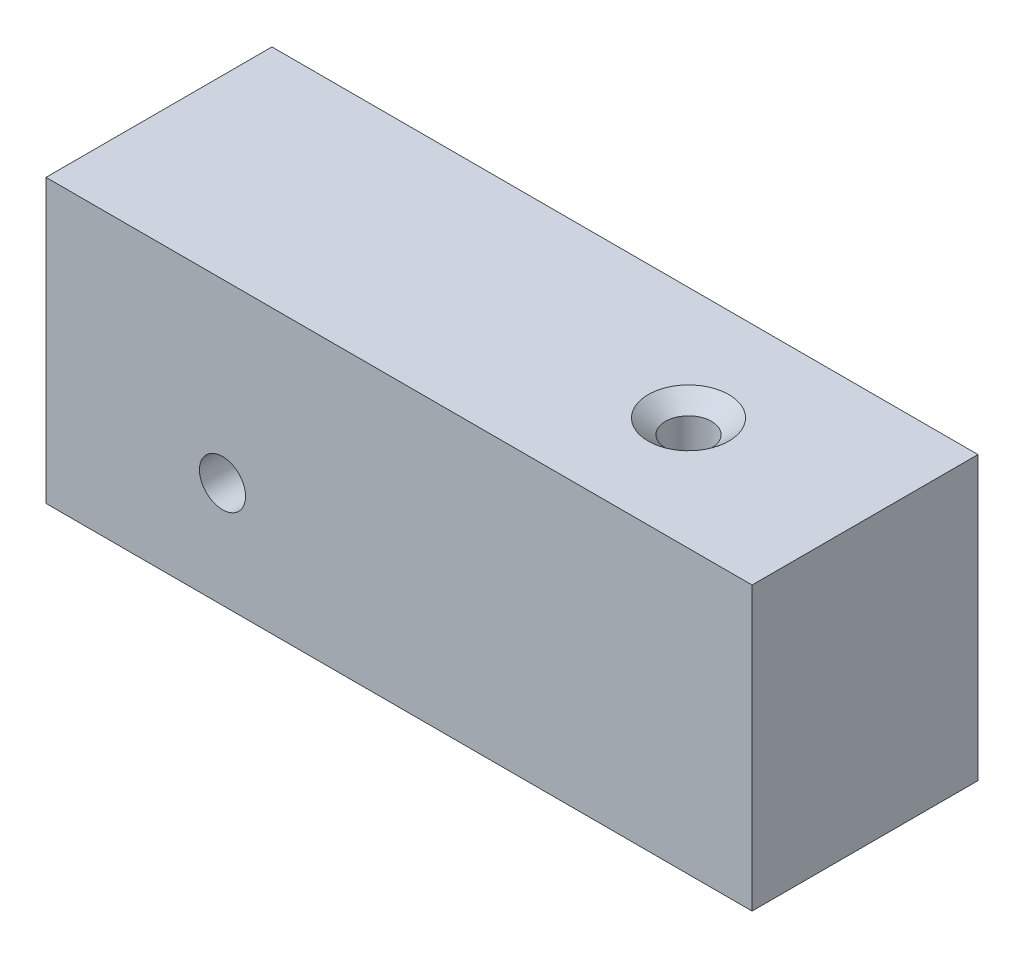
ISO-10303-21;
HEADER;
FILE_DESCRIPTION(('STEP AP214'),'2;1');
FILE_NAME('part.step','',(''),(''),'','','');
FILE_SCHEMA(('AUTOMOTIVE_DESIGN { 1 0 10303 214 1 1 1 1 }'));
ENDSEC;
DATA;
#1=APPLICATION_CONTEXT('core data for automotive mechanical design processes');
#2=APPLICATION_PROTOCOL_DEFINITION('international standard','automotive_design',2000,#1);
#3=PRODUCT_CONTEXT('',#1,'mechanical');
#4=PRODUCT('Part','Part','',(#3));
#5=PRODUCT_RELATED_PRODUCT_CATEGORY('part','',(#4));
#6=PRODUCT_DEFINITION_FORMATION('','',#4);
#7=PRODUCT_DEFINITION_CONTEXT('part definition',#1,'design');
#8=PRODUCT_DEFINITION('design','',#6,#7);
#9=PRODUCT_DEFINITION_SHAPE('','',#8);
#10=(LENGTH_UNIT() NAMED_UNIT(*) SI_UNIT(.MILLI.,.METRE.));
#11=(NAMED_UNIT(*) PLANE_ANGLE_UNIT() SI_UNIT($,.RADIAN.));
#12=(NAMED_UNIT(*) SI_UNIT($,.STERADIAN.) SOLID_ANGLE_UNIT());
#13=UNCERTAINTY_MEASURE_WITH_UNIT(LENGTH_MEASURE(1.E-05),#10,'distance_accuracy_value','');
#14=(GEOMETRIC_REPRESENTATION_CONTEXT(3) GLOBAL_UNCERTAINTY_ASSIGNED_CONTEXT((#13)) GLOBAL_UNIT_ASSIGNED_CONTEXT((#10,
#11,#12)) REPRESENTATION_CONTEXT('',''));
#15=CARTESIAN_POINT('',(0.,0.,0.));
#16=DIRECTION('',(0.,0.,1.));
#17=DIRECTION('',(1.,0.,0.));
#18=AXIS2_PLACEMENT_3D('',#15,#16,#17);
#19=CARTESIAN_POINT('',(-25.,10.,-16.));
#20=DIRECTION('',(0.,-1.,0.));
#21=DIRECTION('',(0.,0.,-1.));
#22=AXIS2_PLACEMENT_3D('',#19,#20,#21);
#23=PLANE('',#22);
#24=CARTESIAN_POINT('',(12.5,10.,-8.));
#25=DIRECTION('',(0.,1.,0.));
#26=DIRECTION('',(0.,0.,1.));
#27=AXIS2_PLACEMENT_3D('',#24,#25,#26);
#28=CIRCLE('',#27,2.8575);
#29=CARTESIAN_POINT('',(12.5,10.,-5.1425));
#30=VERTEX_POINT('',#29);
#31=EDGE_CURVE('E122',#30,#30,#28,.T.);
#32=ORIENTED_EDGE('',*,*,#31,.F.);
#33=EDGE_LOOP('',(#32));
#34=FACE_BOUND('',#33,.T.);
#35=DIRECTION('',(1.,0.,0.));
#36=VECTOR('',#35,1.);
#37=CARTESIAN_POINT('',(-25.,10.,0.));
#38=LINE('',#37,#36);
#39=CARTESIAN_POINT('',(-25.,10.,0.));
#40=VERTEX_POINT('',#39);
#41=CARTESIAN_POINT('',(25.,10.,0.));
#42=VERTEX_POINT('',#41);
#43=EDGE_CURVE('E96',#40,#42,#38,.T.);
#44=ORIENTED_EDGE('',*,*,#43,.T.);
#45=DIRECTION('',(0.,0.,1.));
#46=VECTOR('',#45,1.);
#47=CARTESIAN_POINT('',(25.,10.,-16.));
#48=LINE('',#47,#46);
#49=CARTESIAN_POINT('',(25.,10.,-16.));
#50=VERTEX_POINT('',#49);
#51=EDGE_CURVE('E11',#50,#42,#48,.T.);
#52=ORIENTED_EDGE('',*,*,#51,.F.);
#53=DIRECTION('',(1.,0.,0.));
#54=VECTOR('',#53,1.);
#55=CARTESIAN_POINT('',(-25.,10.,-16.));
#56=LINE('',#55,#54);
#57=CARTESIAN_POINT('',(-25.,10.,-16.));
#58=VERTEX_POINT('',#57);
#59=EDGE_CURVE('E82',#58,#50,#56,.T.);
#60=ORIENTED_EDGE('',*,*,#59,.F.);
#61=DIRECTION('',(0.,0.,1.));
#62=VECTOR('',#61,1.);
#63=CARTESIAN_POINT('',(-25.,10.,-16.));
#64=LINE('',#63,#62);
#65=EDGE_CURVE('E49',#58,#40,#64,.T.);
#66=ORIENTED_EDGE('',*,*,#65,.T.);
#67=EDGE_LOOP('',(#44,#52,#60,#66));
#68=FACE_BOUND('',#67,.T.);
#69=ADVANCED_FACE('F33',(#34,#68),#23,.F.);
#70=CARTESIAN_POINT('',(25.,10.,-16.));
#71=DIRECTION('',(-1.,0.,0.));
#72=DIRECTION('',(0.,0.,1.));
#73=AXIS2_PLACEMENT_3D('',#70,#71,#72);
#74=PLANE('',#73);
#75=DIRECTION('',(0.,-1.,0.));
#76=VECTOR('',#75,1.);
#77=CARTESIAN_POINT('',(25.,10.,0.));
#78=LINE('',#77,#76);
#79=CARTESIAN_POINT('',(25.,-10.,0.));
#80=VERTEX_POINT('',#79);
#81=EDGE_CURVE('E87',#42,#80,#78,.T.);
#82=ORIENTED_EDGE('',*,*,#81,.T.);
#83=DIRECTION('',(0.,0.,1.));
#84=VECTOR('',#83,1.);
#85=CARTESIAN_POINT('',(25.,-10.,-16.));
#86=LINE('',#85,#84);
#87=CARTESIAN_POINT('',(25.,-10.,-16.));
#88=VERTEX_POINT('',#87);
#89=EDGE_CURVE('E41',#88,#80,#86,.T.);
#90=ORIENTED_EDGE('',*,*,#89,.F.);
#91=DIRECTION('',(0.,-1.,0.));
#92=VECTOR('',#91,1.);
#93=CARTESIAN_POINT('',(25.,10.,-16.));
#94=LINE('',#93,#92);
#95=EDGE_CURVE('E74',#50,#88,#94,.T.);
#96=ORIENTED_EDGE('',*,*,#95,.F.);
#97=ORIENTED_EDGE('',*,*,#51,.T.);
#98=EDGE_LOOP('',(#82,#90,#96,#97));
#99=FACE_BOUND('',#98,.T.);
#100=ADVANCED_FACE('F86',(#99),#74,.F.);
#101=CARTESIAN_POINT('',(-25.,-10.,-16.));
#102=DIRECTION('',(0.,-1.,0.));
#103=DIRECTION('',(0.,0.,-1.));
#104=AXIS2_PLACEMENT_3D('',#101,#102,#103);
#105=PLANE('',#104);
#106=CARTESIAN_POINT('',(12.5,-10.,-8.));
#107=DIRECTION('',(0.,-1.,0.));
#108=DIRECTION('',(0.,0.,-1.));
#109=AXIS2_PLACEMENT_3D('',#106,#107,#108);
#110=CIRCLE('',#109,1.63194999999999);
#111=CARTESIAN_POINT('',(12.5,-10.,-9.63194999999999));
#112=VERTEX_POINT('',#111);
#113=EDGE_CURVE('E116',#112,#112,#110,.T.);
#114=ORIENTED_EDGE('',*,*,#113,.F.);
#115=EDGE_LOOP('',(#114));
#116=FACE_BOUND('',#115,.T.);
#117=DIRECTION('',(1.,0.,0.));
#118=VECTOR('',#117,1.);
#119=CARTESIAN_POINT('',(-25.,-10.,0.));
#120=LINE('',#119,#118);
#121=CARTESIAN_POINT('',(-25.,-10.,0.));
#122=VERTEX_POINT('',#121);
#123=EDGE_CURVE('E100',#122,#80,#120,.T.);
#124=ORIENTED_EDGE('',*,*,#123,.F.);
#125=DIRECTION('',(0.,0.,1.));
#126=VECTOR('',#125,1.);
#127=CARTESIAN_POINT('',(-25.,-10.,-16.));
#128=LINE('',#127,#126);
#129=CARTESIAN_POINT('',(-25.,-10.,-16.));
#130=VERTEX_POINT('',#129);
#131=EDGE_CURVE('E63',#130,#122,#128,.T.);
#132=ORIENTED_EDGE('',*,*,#131,.F.);
#133=DIRECTION('',(1.,0.,0.));
#134=VECTOR('',#133,1.);
#135=CARTESIAN_POINT('',(-25.,-10.,-16.));
#136=LINE('',#135,#134);
#137=EDGE_CURVE('E81',#130,#88,#136,.T.);
#138=ORIENTED_EDGE('',*,*,#137,.T.);
#139=ORIENTED_EDGE('',*,*,#89,.T.);
#140=EDGE_LOOP('',(#124,#132,#138,#139));
#141=FACE_BOUND('',#140,.T.);
#142=ADVANCED_FACE('F90',(#116,#141),#105,.T.);
#143=CARTESIAN_POINT('',(-25.,10.,-16.));
#144=DIRECTION('',(-1.,0.,0.));
#145=DIRECTION('',(0.,0.,1.));
#146=AXIS2_PLACEMENT_3D('',#143,#144,#145);
#147=PLANE('',#146);
#148=DIRECTION('',(0.,-1.,0.));
#149=VECTOR('',#148,1.);
#150=CARTESIAN_POINT('',(-25.,10.,0.));
#151=LINE('',#150,#149);
#152=EDGE_CURVE('E102',#40,#122,#151,.T.);
#153=ORIENTED_EDGE('',*,*,#152,.F.);
#154=ORIENTED_EDGE('',*,*,#65,.F.);
#155=DIRECTION('',(0.,-1.,0.));
#156=VECTOR('',#155,1.);
#157=CARTESIAN_POINT('',(-25.,10.,-16.));
#158=LINE('',#157,#156);
#159=EDGE_CURVE('E91',#58,#130,#158,.T.);
#160=ORIENTED_EDGE('',*,*,#159,.T.);
#161=ORIENTED_EDGE('',*,*,#131,.T.);
#162=EDGE_LOOP('',(#153,#154,#160,#161));
#163=FACE_BOUND('',#162,.T.);
#164=ADVANCED_FACE('F130',(#163),#147,.T.);
#165=CARTESIAN_POINT('',(0.,0.,-16.));
#166=DIRECTION('',(0.,0.,-1.));
#167=DIRECTION('',(-1.,0.,0.));
#168=AXIS2_PLACEMENT_3D('',#165,#166,#167);
#169=PLANE('',#168);
#170=CARTESIAN_POINT('',(-12.5,-2.5,-16.));
#171=DIRECTION('',(0.,0.,-1.));
#172=DIRECTION('',(-1.,0.,0.));
#173=AXIS2_PLACEMENT_3D('',#170,#171,#172);
#174=CIRCLE('',#173,2.8575);
#175=CARTESIAN_POINT('',(-15.3575,-2.5,-16.));
#176=VERTEX_POINT('',#175);
#177=EDGE_CURVE('E113',#176,#176,#174,.T.);
#178=ORIENTED_EDGE('',*,*,#177,.F.);
#179=EDGE_LOOP('',(#178));
#180=FACE_BOUND('',#179,.T.);
#181=ORIENTED_EDGE('',*,*,#59,.T.);
#182=ORIENTED_EDGE('',*,*,#95,.T.);
#183=ORIENTED_EDGE('',*,*,#137,.F.);
#184=ORIENTED_EDGE('',*,*,#159,.F.);
#185=EDGE_LOOP('',(#181,#182,#183,#184));
#186=FACE_BOUND('',#185,.T.);
#187=ADVANCED_FACE('F78',(#180,#186),#169,.T.);
#188=CARTESIAN_POINT('',(0.,0.,0.));
#189=DIRECTION('',(0.,0.,-1.));
#190=DIRECTION('',(-1.,0.,0.));
#191=AXIS2_PLACEMENT_3D('',#188,#189,#190);
#192=PLANE('',#191);
#193=CARTESIAN_POINT('',(-12.5,-2.5,0.));
#194=DIRECTION('',(0.,0.,-1.));
#195=DIRECTION('',(-1.,0.,0.));
#196=AXIS2_PLACEMENT_3D('',#193,#194,#195);
#197=CIRCLE('',#196,1.63194999999999);
#198=CARTESIAN_POINT('',(-14.13195,-2.5,0.));
#199=VERTEX_POINT('',#198);
#200=EDGE_CURVE('E98',#199,#199,#197,.T.);
#201=ORIENTED_EDGE('',*,*,#200,.T.);
#202=EDGE_LOOP('',(#201));
#203=FACE_BOUND('',#202,.T.);
#204=ORIENTED_EDGE('',*,*,#43,.F.);
#205=ORIENTED_EDGE('',*,*,#152,.T.);
#206=ORIENTED_EDGE('',*,*,#123,.T.);
#207=ORIENTED_EDGE('',*,*,#81,.F.);
#208=EDGE_LOOP('',(#204,#205,#206,#207));
#209=FACE_BOUND('',#208,.T.);
#210=ADVANCED_FACE('F129',(#203,#209),#192,.F.);
#211=CARTESIAN_POINT('',(-12.5,-2.5,-16.));
#212=DIRECTION('',(0.,0.,-1.));
#213=DIRECTION('',(-1.,0.,0.));
#214=AXIS2_PLACEMENT_3D('',#211,#212,#213);
#215=CYLINDRICAL_SURFACE('',#214,1.63194999999999);
#216=ORIENTED_EDGE('',*,*,#200,.F.);
#217=EDGE_LOOP('',(#216));
#218=FACE_BOUND('',#217,.T.);
#219=CARTESIAN_POINT('',(-12.5,-2.5,-14.9716414470107));
#220=DIRECTION('',(0.,0.,-1.));
#221=DIRECTION('',(-1.,0.,0.));
#222=AXIS2_PLACEMENT_3D('',#219,#220,#221);
#223=CIRCLE('',#222,1.63194999999999);
#224=CARTESIAN_POINT('',(-14.13195,-2.5,-14.9716414470107));
#225=VERTEX_POINT('',#224);
#226=EDGE_CURVE('E110',#225,#225,#223,.T.);
#227=ORIENTED_EDGE('',*,*,#226,.T.);
#228=EDGE_LOOP('',(#227));
#229=FACE_BOUND('',#228,.T.);
#230=ADVANCED_FACE('F184',(#218,#229),#215,.F.);
#231=CARTESIAN_POINT('',(-12.5,-2.5,-16.));
#232=DIRECTION('',(0.,0.,-1.));
#233=DIRECTION('',(-1.,0.,0.));
#234=AXIS2_PLACEMENT_3D('',#231,#232,#233);
#235=CONICAL_SURFACE('',#234,2.8575,0.872664625997163);
#236=ORIENTED_EDGE('',*,*,#226,.F.);
#237=EDGE_LOOP('',(#236));
#238=FACE_BOUND('',#237,.T.);
#239=ORIENTED_EDGE('',*,*,#177,.T.);
#240=EDGE_LOOP('',(#239));
#241=FACE_BOUND('',#240,.T.);
#242=ADVANCED_FACE('F165',(#238,#241),#235,.F.);
#243=CARTESIAN_POINT('',(12.5,10.,-8.));
#244=DIRECTION('',(0.,1.,0.));
#245=DIRECTION('',(0.,0.,1.));
#246=AXIS2_PLACEMENT_3D('',#243,#244,#245);
#247=CYLINDRICAL_SURFACE('',#246,1.63194999999999);
#248=CARTESIAN_POINT('',(12.5,8.97164144701067,-8.));
#249=DIRECTION('',(0.,1.,0.));
#250=DIRECTION('',(0.,0.,1.));
#251=AXIS2_PLACEMENT_3D('',#248,#249,#250);
#252=CIRCLE('',#251,1.63194999999999);
#253=CARTESIAN_POINT('',(12.5,8.97164144701067,-6.36805000000001));
#254=VERTEX_POINT('',#253);
#255=EDGE_CURVE('E119',#254,#254,#252,.T.);
#256=ORIENTED_EDGE('',*,*,#255,.T.);
#257=EDGE_LOOP('',(#256));
#258=FACE_BOUND('',#257,.T.);
#259=ORIENTED_EDGE('',*,*,#113,.T.);
#260=EDGE_LOOP('',(#259));
#261=FACE_BOUND('',#260,.T.);
#262=ADVANCED_FACE('F160',(#258,#261),#247,.F.);
#263=CARTESIAN_POINT('',(12.5,10.,-8.));
#264=DIRECTION('',(0.,1.,0.));
#265=DIRECTION('',(0.,0.,1.));
#266=AXIS2_PLACEMENT_3D('',#263,#264,#265);
#267=CONICAL_SURFACE('',#266,2.8575,0.872664625997162);
#268=ORIENTED_EDGE('',*,*,#255,.F.);
#269=EDGE_LOOP('',(#268));
#270=FACE_BOUND('',#269,.T.);
#271=ORIENTED_EDGE('',*,*,#31,.T.);
#272=EDGE_LOOP('',(#271));
#273=FACE_BOUND('',#272,.T.);
#274=ADVANCED_FACE('F126',(#270,#273),#267,.F.);
#275=CLOSED_SHELL('',(#69,#100,#142,#164,#187,#210,#230,#242,#262,#274));
#276=MANIFOLD_SOLID_BREP('B2',#275);
#277=ADVANCED_BREP_SHAPE_REPRESENTATION('',(#18,#276),#14);
#278=SHAPE_DEFINITION_REPRESENTATION(#9,#277);
ENDSEC;
END-ISO-10303-21;
